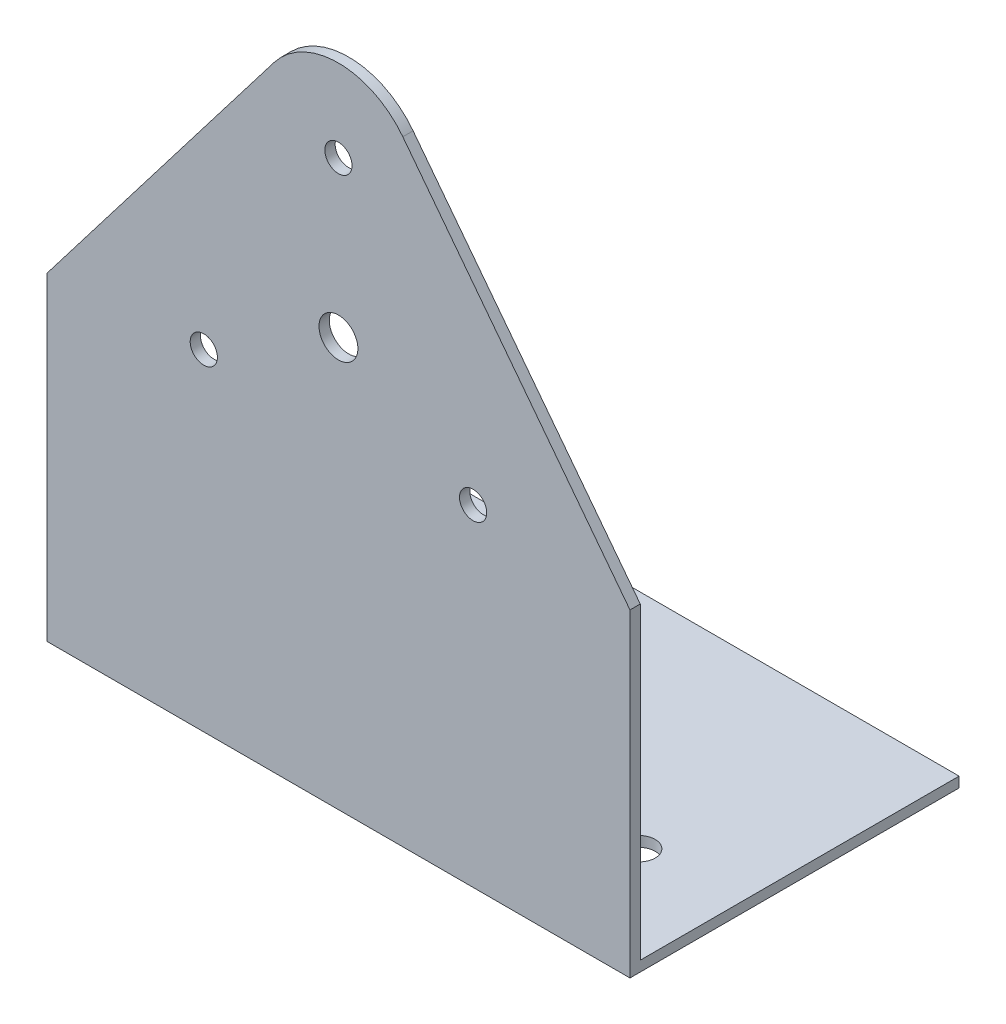
ISO-10303-21;
HEADER;
FILE_DESCRIPTION(('STEP AP214'),'2;1');
FILE_NAME('part.step','',(''),(''),'','','');
FILE_SCHEMA(('AUTOMOTIVE_DESIGN { 1 0 10303 214 1 1 1 1 }'));
ENDSEC;
DATA;
#1=APPLICATION_CONTEXT('core data for automotive mechanical design processes');
#2=APPLICATION_PROTOCOL_DEFINITION('international standard','automotive_design',2000,#1);
#3=PRODUCT_CONTEXT('',#1,'mechanical');
#4=PRODUCT('Part','Part','',(#3));
#5=PRODUCT_RELATED_PRODUCT_CATEGORY('part','',(#4));
#6=PRODUCT_DEFINITION_FORMATION('','',#4);
#7=PRODUCT_DEFINITION_CONTEXT('part definition',#1,'design');
#8=PRODUCT_DEFINITION('design','',#6,#7);
#9=PRODUCT_DEFINITION_SHAPE('','',#8);
#10=(LENGTH_UNIT() NAMED_UNIT(*) SI_UNIT(.MILLI.,.METRE.));
#11=(NAMED_UNIT(*) PLANE_ANGLE_UNIT() SI_UNIT($,.RADIAN.));
#12=(NAMED_UNIT(*) SI_UNIT($,.STERADIAN.) SOLID_ANGLE_UNIT());
#13=UNCERTAINTY_MEASURE_WITH_UNIT(LENGTH_MEASURE(1.E-05),#10,'distance_accuracy_value','');
#14=(GEOMETRIC_REPRESENTATION_CONTEXT(3) GLOBAL_UNCERTAINTY_ASSIGNED_CONTEXT((#13)) GLOBAL_UNIT_ASSIGNED_CONTEXT((#10,
#11,#12)) REPRESENTATION_CONTEXT('',''));
#15=CARTESIAN_POINT('',(0.,0.,0.));
#16=DIRECTION('',(0.,0.,1.));
#17=DIRECTION('',(1.,0.,0.));
#18=AXIS2_PLACEMENT_3D('',#15,#16,#17);
#19=CARTESIAN_POINT('',(90.,0.,0.));
#20=DIRECTION('',(0.,1.,0.));
#21=DIRECTION('',(0.,0.,1.));
#22=AXIS2_PLACEMENT_3D('',#19,#20,#21);
#23=PLANE('',#22);
#24=CARTESIAN_POINT('',(15.,0.,-16.3875));
#25=DIRECTION('',(0.,-1.,0.));
#26=DIRECTION('',(0.,0.,-1.));
#27=AXIS2_PLACEMENT_3D('',#24,#25,#26);
#28=CIRCLE('',#27,2.5);
#29=CARTESIAN_POINT('',(15.,0.,-18.8875));
#30=VERTEX_POINT('',#29);
#31=EDGE_CURVE('E160',#30,#30,#28,.T.);
#32=ORIENTED_EDGE('',*,*,#31,.F.);
#33=EDGE_LOOP('',(#32));
#34=FACE_BOUND('',#33,.T.);
#35=CARTESIAN_POINT('',(75.,0.,-16.3875));
#36=DIRECTION('',(0.,-1.,0.));
#37=DIRECTION('',(0.,0.,-1.));
#38=AXIS2_PLACEMENT_3D('',#35,#36,#37);
#39=CIRCLE('',#38,2.50000000000001);
#40=CARTESIAN_POINT('',(75.,0.,-18.8875));
#41=VERTEX_POINT('',#40);
#42=EDGE_CURVE('E168',#41,#41,#39,.T.);
#43=ORIENTED_EDGE('',*,*,#42,.F.);
#44=EDGE_LOOP('',(#43));
#45=FACE_BOUND('',#44,.T.);
#46=DIRECTION('',(0.,0.,-1.));
#47=VECTOR('',#46,1.);
#48=CARTESIAN_POINT('',(0.,0.,0.));
#49=LINE('',#48,#47);
#50=CARTESIAN_POINT('',(0.,0.,0.));
#51=VERTEX_POINT('',#50);
#52=CARTESIAN_POINT('',(0.,0.,-50.8));
#53=VERTEX_POINT('',#52);
#54=EDGE_CURVE('E133',#51,#53,#49,.T.);
#55=ORIENTED_EDGE('',*,*,#54,.T.);
#56=DIRECTION('',(-1.,0.,0.));
#57=VECTOR('',#56,1.);
#58=CARTESIAN_POINT('',(90.,0.,-50.8));
#59=LINE('',#58,#57);
#60=CARTESIAN_POINT('',(90.,0.,-50.8));
#61=VERTEX_POINT('',#60);
#62=EDGE_CURVE('E121',#61,#53,#59,.T.);
#63=ORIENTED_EDGE('',*,*,#62,.F.);
#64=DIRECTION('',(0.,0.,-1.));
#65=VECTOR('',#64,1.);
#66=CARTESIAN_POINT('',(90.,0.,0.));
#67=LINE('',#66,#65);
#68=CARTESIAN_POINT('',(90.,0.,0.));
#69=VERTEX_POINT('',#68);
#70=EDGE_CURVE('E135',#69,#61,#67,.T.);
#71=ORIENTED_EDGE('',*,*,#70,.F.);
#72=DIRECTION('',(-1.,0.,0.));
#73=VECTOR('',#72,1.);
#74=CARTESIAN_POINT('',(90.,0.,0.));
#75=LINE('',#74,#73);
#76=EDGE_CURVE('E145',#69,#51,#75,.T.);
#77=ORIENTED_EDGE('',*,*,#76,.T.);
#78=EDGE_LOOP('',(#55,#63,#71,#77));
#79=FACE_BOUND('',#78,.T.);
#80=ADVANCED_FACE('F38',(#34,#45,#79),#23,.F.);
#81=CARTESIAN_POINT('',(90.,0.,-50.8));
#82=DIRECTION('',(0.,0.,1.));
#83=DIRECTION('',(1.,0.,0.));
#84=AXIS2_PLACEMENT_3D('',#81,#82,#83);
#85=PLANE('',#84);
#86=DIRECTION('',(0.,1.,0.));
#87=VECTOR('',#86,1.);
#88=CARTESIAN_POINT('',(0.,0.,-50.8));
#89=LINE('',#88,#87);
#90=CARTESIAN_POINT('',(0.,1.5875,-50.8));
#91=VERTEX_POINT('',#90);
#92=EDGE_CURVE('E240',#53,#91,#89,.T.);
#93=ORIENTED_EDGE('',*,*,#92,.T.);
#94=DIRECTION('',(-1.,0.,0.));
#95=VECTOR('',#94,1.);
#96=CARTESIAN_POINT('',(90.,1.5875,-50.8));
#97=LINE('',#96,#95);
#98=CARTESIAN_POINT('',(90.,1.5875,-50.8));
#99=VERTEX_POINT('',#98);
#100=EDGE_CURVE('E152',#99,#91,#97,.T.);
#101=ORIENTED_EDGE('',*,*,#100,.F.);
#102=DIRECTION('',(0.,1.,0.));
#103=VECTOR('',#102,1.);
#104=CARTESIAN_POINT('',(90.,0.,-50.8));
#105=LINE('',#104,#103);
#106=EDGE_CURVE('E94',#61,#99,#105,.T.);
#107=ORIENTED_EDGE('',*,*,#106,.F.);
#108=ORIENTED_EDGE('',*,*,#62,.T.);
#109=EDGE_LOOP('',(#93,#101,#107,#108));
#110=FACE_BOUND('',#109,.T.);
#111=ADVANCED_FACE('F254',(#110),#85,.F.);
#112=CARTESIAN_POINT('',(90.,1.5875,-1.5875));
#113=DIRECTION('',(0.,-1.,0.));
#114=DIRECTION('',(0.,0.,-1.));
#115=AXIS2_PLACEMENT_3D('',#112,#113,#114);
#116=PLANE('',#115);
#117=CARTESIAN_POINT('',(15.,1.58750000000001,-16.3875));
#118=DIRECTION('',(0.,-1.,0.));
#119=DIRECTION('',(0.,0.,-1.));
#120=AXIS2_PLACEMENT_3D('',#117,#118,#119);
#121=CIRCLE('',#120,2.5);
#122=CARTESIAN_POINT('',(15.,1.58750000000001,-18.8875));
#123=VERTEX_POINT('',#122);
#124=EDGE_CURVE('E41',#123,#123,#121,.T.);
#125=ORIENTED_EDGE('',*,*,#124,.T.);
#126=EDGE_LOOP('',(#125));
#127=FACE_BOUND('',#126,.T.);
#128=CARTESIAN_POINT('',(75.,1.58750000000001,-16.3875));
#129=DIRECTION('',(0.,-1.,0.));
#130=DIRECTION('',(0.,0.,-1.));
#131=AXIS2_PLACEMENT_3D('',#128,#129,#130);
#132=CIRCLE('',#131,2.50000000000001);
#133=CARTESIAN_POINT('',(75.,1.58750000000001,-18.8875));
#134=VERTEX_POINT('',#133);
#135=EDGE_CURVE('E157',#134,#134,#132,.T.);
#136=ORIENTED_EDGE('',*,*,#135,.T.);
#137=EDGE_LOOP('',(#136));
#138=FACE_BOUND('',#137,.T.);
#139=DIRECTION('',(0.,0.,1.));
#140=VECTOR('',#139,1.);
#141=CARTESIAN_POINT('',(0.,1.5875,-1.5875));
#142=LINE('',#141,#140);
#143=CARTESIAN_POINT('',(0.,1.5875,-1.5875));
#144=VERTEX_POINT('',#143);
#145=EDGE_CURVE('E141',#91,#144,#142,.T.);
#146=ORIENTED_EDGE('',*,*,#145,.T.);
#147=DIRECTION('',(-1.,0.,0.));
#148=VECTOR('',#147,1.);
#149=CARTESIAN_POINT('',(90.,1.5875,-1.5875));
#150=LINE('',#149,#148);
#151=CARTESIAN_POINT('',(90.,1.5875,-1.5875));
#152=VERTEX_POINT('',#151);
#153=EDGE_CURVE('E148',#152,#144,#150,.T.);
#154=ORIENTED_EDGE('',*,*,#153,.F.);
#155=DIRECTION('',(0.,0.,1.));
#156=VECTOR('',#155,1.);
#157=CARTESIAN_POINT('',(90.,1.5875,-1.5875));
#158=LINE('',#157,#156);
#159=EDGE_CURVE('E229',#99,#152,#158,.T.);
#160=ORIENTED_EDGE('',*,*,#159,.F.);
#161=ORIENTED_EDGE('',*,*,#100,.T.);
#162=EDGE_LOOP('',(#146,#154,#160,#161));
#163=FACE_BOUND('',#162,.T.);
#164=ADVANCED_FACE('F246',(#127,#138,#163),#116,.F.);
#165=CARTESIAN_POINT('',(90.,1.5875,-1.5875));
#166=DIRECTION('',(0.,0.,1.));
#167=DIRECTION('',(0.,-1.,0.));
#168=AXIS2_PLACEMENT_3D('',#165,#166,#167);
#169=PLANE('',#168);
#170=CARTESIAN_POINT('',(45.,87.1212211943911,-1.5875));
#171=DIRECTION('',(0.,0.,1.));
#172=DIRECTION('',(0.,-1.,0.));
#173=AXIS2_PLACEMENT_3D('',#170,#171,#172);
#174=CIRCLE('',#173,2.1);
#175=CARTESIAN_POINT('',(45.,85.0212211943911,-1.5875));
#176=VERTEX_POINT('',#175);
#177=EDGE_CURVE('E128',#176,#176,#174,.T.);
#178=ORIENTED_EDGE('',*,*,#177,.T.);
#179=EDGE_LOOP('',(#178));
#180=FACE_BOUND('',#179,.T.);
#181=CARTESIAN_POINT('',(45.,63.1212211943911,-1.5875));
#182=DIRECTION('',(0.,0.,1.));
#183=DIRECTION('',(0.,-1.,0.));
#184=AXIS2_PLACEMENT_3D('',#181,#182,#183);
#185=CIRCLE('',#184,3.);
#186=CARTESIAN_POINT('',(45.,60.1212211943911,-1.5875));
#187=VERTEX_POINT('',#186);
#188=EDGE_CURVE('E199',#187,#187,#185,.T.);
#189=ORIENTED_EDGE('',*,*,#188,.T.);
#190=EDGE_LOOP('',(#189));
#191=FACE_BOUND('',#190,.T.);
#192=CARTESIAN_POINT('',(65.7846096908275,51.1212211943916,-1.5875));
#193=DIRECTION('',(0.,0.,1.));
#194=DIRECTION('',(0.,-1.,0.));
#195=AXIS2_PLACEMENT_3D('',#192,#193,#194);
#196=CIRCLE('',#195,2.1);
#197=CARTESIAN_POINT('',(65.7846096908275,49.0212211943916,-1.5875));
#198=VERTEX_POINT('',#197);
#199=EDGE_CURVE('E195',#198,#198,#196,.T.);
#200=ORIENTED_EDGE('',*,*,#199,.T.);
#201=EDGE_LOOP('',(#200));
#202=FACE_BOUND('',#201,.T.);
#203=CARTESIAN_POINT('',(24.2153903091735,51.1212211943911,-1.5875));
#204=DIRECTION('',(0.,0.,1.));
#205=DIRECTION('',(0.,-1.,0.));
#206=AXIS2_PLACEMENT_3D('',#203,#204,#205);
#207=CIRCLE('',#206,2.09999999999909);
#208=CARTESIAN_POINT('',(24.2153903091735,49.021221194392,-1.5875));
#209=VERTEX_POINT('',#208);
#210=EDGE_CURVE('E180',#209,#209,#207,.T.);
#211=ORIENTED_EDGE('',*,*,#210,.T.);
#212=EDGE_LOOP('',(#211));
#213=FACE_BOUND('',#212,.T.);
#214=CARTESIAN_POINT('',(45.,87.3,-1.5875));
#215=DIRECTION('',(0.,0.,1.));
#216=DIRECTION('',(0.,-1.,0.));
#217=AXIS2_PLACEMENT_3D('',#214,#215,#216);
#218=CIRCLE('',#217,12.5212211943911);
#219=CARTESIAN_POINT('',(35.0643782178029,94.92,-1.5875));
#220=VERTEX_POINT('',#219);
#221=CARTESIAN_POINT('',(54.9356217821971,94.92,-1.5875));
#222=VERTEX_POINT('',#221);
#223=EDGE_CURVE('E223',#220,#222,#218,.F.);
#224=ORIENTED_EDGE('',*,*,#223,.T.);
#225=DIRECTION('',(0.608566838785132,-0.793502616713437,0.));
#226=VECTOR('',#225,1.);
#227=CARTESIAN_POINT('',(112.992046683639,19.2209606499669,-1.5875));
#228=LINE('',#227,#226);
#229=CARTESIAN_POINT('',(90.,49.2,-1.5875));
#230=VERTEX_POINT('',#229);
#231=EDGE_CURVE('E219',#222,#230,#228,.T.);
#232=ORIENTED_EDGE('',*,*,#231,.T.);
#233=DIRECTION('',(0.,1.,0.));
#234=VECTOR('',#233,1.);
#235=CARTESIAN_POINT('',(90.,1.5875,-1.5875));
#236=LINE('',#235,#234);
#237=EDGE_CURVE('E232',#152,#230,#236,.T.);
#238=ORIENTED_EDGE('',*,*,#237,.F.);
#239=ORIENTED_EDGE('',*,*,#153,.T.);
#240=DIRECTION('',(0.,1.,0.));
#241=VECTOR('',#240,1.);
#242=CARTESIAN_POINT('',(0.,1.5875,-1.5875));
#243=LINE('',#242,#241);
#244=CARTESIAN_POINT('',(0.,49.2,-1.5875));
#245=VERTEX_POINT('',#244);
#246=EDGE_CURVE('E136',#144,#245,#243,.T.);
#247=ORIENTED_EDGE('',*,*,#246,.T.);
#248=DIRECTION('',(0.608566838785132,0.793502616713437,0.));
#249=VECTOR('',#248,1.);
#250=CARTESIAN_POINT('',(10.339777070565,62.6819047618592,-1.5875));
#251=LINE('',#250,#249);
#252=EDGE_CURVE('E55',#245,#220,#251,.T.);
#253=ORIENTED_EDGE('',*,*,#252,.T.);
#254=EDGE_LOOP('',(#224,#232,#238,#239,#247,#253));
#255=FACE_BOUND('',#254,.T.);
#256=ADVANCED_FACE('F250',(#180,#191,#202,#213,#255),#169,.F.);
#257=CARTESIAN_POINT('',(90.,0.,0.));
#258=DIRECTION('',(0.,0.,-1.));
#259=DIRECTION('',(-1.,0.,0.));
#260=AXIS2_PLACEMENT_3D('',#257,#258,#259);
#261=PLANE('',#260);
#262=CARTESIAN_POINT('',(45.,87.1212211943911,0.));
#263=DIRECTION('',(0.,0.,1.));
#264=DIRECTION('',(1.,0.,0.));
#265=AXIS2_PLACEMENT_3D('',#262,#263,#264);
#266=CIRCLE('',#265,2.1);
#267=CARTESIAN_POINT('',(47.1,87.1212211943911,0.));
#268=VERTEX_POINT('',#267);
#269=EDGE_CURVE('E176',#268,#268,#266,.T.);
#270=ORIENTED_EDGE('',*,*,#269,.F.);
#271=EDGE_LOOP('',(#270));
#272=FACE_BOUND('',#271,.T.);
#273=CARTESIAN_POINT('',(45.,63.1212211943911,0.));
#274=DIRECTION('',(0.,0.,1.));
#275=DIRECTION('',(1.,0.,0.));
#276=AXIS2_PLACEMENT_3D('',#273,#274,#275);
#277=CIRCLE('',#276,3.);
#278=CARTESIAN_POINT('',(48.,63.1212211943911,0.));
#279=VERTEX_POINT('',#278);
#280=EDGE_CURVE('E181',#279,#279,#277,.T.);
#281=ORIENTED_EDGE('',*,*,#280,.F.);
#282=EDGE_LOOP('',(#281));
#283=FACE_BOUND('',#282,.T.);
#284=CARTESIAN_POINT('',(65.7846096908275,51.1212211943916,0.));
#285=DIRECTION('',(0.,0.,1.));
#286=DIRECTION('',(1.,0.,0.));
#287=AXIS2_PLACEMENT_3D('',#284,#285,#286);
#288=CIRCLE('',#287,2.1);
#289=CARTESIAN_POINT('',(67.8846096908275,51.1212211943916,0.));
#290=VERTEX_POINT('',#289);
#291=EDGE_CURVE('E185',#290,#290,#288,.T.);
#292=ORIENTED_EDGE('',*,*,#291,.F.);
#293=EDGE_LOOP('',(#292));
#294=FACE_BOUND('',#293,.T.);
#295=CARTESIAN_POINT('',(24.2153903091735,51.1212211943911,0.));
#296=DIRECTION('',(0.,0.,1.));
#297=DIRECTION('',(1.,0.,0.));
#298=AXIS2_PLACEMENT_3D('',#295,#296,#297);
#299=CIRCLE('',#298,2.09999999999909);
#300=CARTESIAN_POINT('',(26.3153903091726,51.1212211943911,0.));
#301=VERTEX_POINT('',#300);
#302=EDGE_CURVE('E166',#301,#301,#299,.T.);
#303=ORIENTED_EDGE('',*,*,#302,.F.);
#304=EDGE_LOOP('',(#303));
#305=FACE_BOUND('',#304,.T.);
#306=DIRECTION('',(0.,-1.,0.));
#307=VECTOR('',#306,1.);
#308=CARTESIAN_POINT('',(90.,0.,0.));
#309=LINE('',#308,#307);
#310=CARTESIAN_POINT('',(90.,49.2,0.));
#311=VERTEX_POINT('',#310);
#312=EDGE_CURVE('E64',#311,#69,#309,.T.);
#313=ORIENTED_EDGE('',*,*,#312,.F.);
#314=DIRECTION('',(0.608566838785132,-0.793502616713437,0.));
#315=VECTOR('',#314,1.);
#316=CARTESIAN_POINT('',(54.9356217821971,94.92,0.));
#317=LINE('',#316,#315);
#318=CARTESIAN_POINT('',(54.9356217821971,94.92,0.));
#319=VERTEX_POINT('',#318);
#320=EDGE_CURVE('E208',#319,#311,#317,.T.);
#321=ORIENTED_EDGE('',*,*,#320,.F.);
#322=CARTESIAN_POINT('',(45.,87.3,0.));
#323=DIRECTION('',(0.,0.,-1.));
#324=DIRECTION('',(1.,0.,0.));
#325=AXIS2_PLACEMENT_3D('',#322,#323,#324);
#326=CIRCLE('',#325,12.5212211943911);
#327=CARTESIAN_POINT('',(35.0643782178029,94.92,0.));
#328=VERTEX_POINT('',#327);
#329=EDGE_CURVE('E126',#328,#319,#326,.T.);
#330=ORIENTED_EDGE('',*,*,#329,.F.);
#331=DIRECTION('',(0.608566838785132,0.793502616713437,0.));
#332=VECTOR('',#331,1.);
#333=CARTESIAN_POINT('',(35.0643782178029,94.92,0.));
#334=LINE('',#333,#332);
#335=CARTESIAN_POINT('',(0.,49.2,0.));
#336=VERTEX_POINT('',#335);
#337=EDGE_CURVE('E115',#336,#328,#334,.T.);
#338=ORIENTED_EDGE('',*,*,#337,.F.);
#339=DIRECTION('',(0.,-1.,0.));
#340=VECTOR('',#339,1.);
#341=CARTESIAN_POINT('',(0.,0.,0.));
#342=LINE('',#341,#340);
#343=EDGE_CURVE('E86',#336,#51,#342,.T.);
#344=ORIENTED_EDGE('',*,*,#343,.T.);
#345=ORIENTED_EDGE('',*,*,#76,.F.);
#346=EDGE_LOOP('',(#313,#321,#330,#338,#344,#345));
#347=FACE_BOUND('',#346,.T.);
#348=ADVANCED_FACE('F123',(#272,#283,#294,#305,#347),#261,.F.);
#349=CARTESIAN_POINT('',(90.,0.,0.));
#350=DIRECTION('',(1.,0.,0.));
#351=DIRECTION('',(0.,0.,-1.));
#352=AXIS2_PLACEMENT_3D('',#349,#350,#351);
#353=PLANE('',#352);
#354=DIRECTION('',(0.,0.,-1.));
#355=VECTOR('',#354,1.);
#356=CARTESIAN_POINT('',(90.,49.2,0.));
#357=LINE('',#356,#355);
#358=EDGE_CURVE('E11',#311,#230,#357,.T.);
#359=ORIENTED_EDGE('',*,*,#358,.F.);
#360=ORIENTED_EDGE('',*,*,#312,.T.);
#361=ORIENTED_EDGE('',*,*,#70,.T.);
#362=ORIENTED_EDGE('',*,*,#106,.T.);
#363=ORIENTED_EDGE('',*,*,#159,.T.);
#364=ORIENTED_EDGE('',*,*,#237,.T.);
#365=EDGE_LOOP('',(#359,#360,#361,#362,#363,#364));
#366=FACE_BOUND('',#365,.T.);
#367=ADVANCED_FACE('F251',(#366),#353,.T.);
#368=CARTESIAN_POINT('',(0.,0.,0.));
#369=DIRECTION('',(1.,0.,0.));
#370=DIRECTION('',(0.,0.,-1.));
#371=AXIS2_PLACEMENT_3D('',#368,#369,#370);
#372=PLANE('',#371);
#373=ORIENTED_EDGE('',*,*,#343,.F.);
#374=DIRECTION('',(0.,0.,-1.));
#375=VECTOR('',#374,1.);
#376=CARTESIAN_POINT('',(0.,49.2,0.));
#377=LINE('',#376,#375);
#378=EDGE_CURVE('E47',#336,#245,#377,.T.);
#379=ORIENTED_EDGE('',*,*,#378,.T.);
#380=ORIENTED_EDGE('',*,*,#246,.F.);
#381=ORIENTED_EDGE('',*,*,#145,.F.);
#382=ORIENTED_EDGE('',*,*,#92,.F.);
#383=ORIENTED_EDGE('',*,*,#54,.F.);
#384=EDGE_LOOP('',(#373,#379,#380,#381,#382,#383));
#385=FACE_BOUND('',#384,.T.);
#386=ADVANCED_FACE('F131',(#385),#372,.F.);
#387=CARTESIAN_POINT('',(45.,87.3,-50.8));
#388=DIRECTION('',(0.,0.,1.));
#389=DIRECTION('',(1.,0.,0.));
#390=AXIS2_PLACEMENT_3D('',#387,#388,#389);
#391=CYLINDRICAL_SURFACE('',#390,12.5212211943911);
#392=DIRECTION('',(0.,0.,1.));
#393=VECTOR('',#392,1.);
#394=CARTESIAN_POINT('',(35.0643782178029,94.92,-50.8));
#395=LINE('',#394,#393);
#396=EDGE_CURVE('E211',#220,#328,#395,.T.);
#397=ORIENTED_EDGE('',*,*,#396,.T.);
#398=ORIENTED_EDGE('',*,*,#329,.T.);
#399=DIRECTION('',(0.,0.,1.));
#400=VECTOR('',#399,1.);
#401=CARTESIAN_POINT('',(54.9356217821971,94.92,-50.8));
#402=LINE('',#401,#400);
#403=EDGE_CURVE('E212',#222,#319,#402,.T.);
#404=ORIENTED_EDGE('',*,*,#403,.F.);
#405=ORIENTED_EDGE('',*,*,#223,.F.);
#406=EDGE_LOOP('',(#397,#398,#404,#405));
#407=FACE_BOUND('',#406,.T.);
#408=ADVANCED_FACE('F260',(#407),#391,.T.);
#409=CARTESIAN_POINT('',(54.9356217821971,94.92,-50.8));
#410=DIRECTION('',(-0.793502616713437,-0.608566838785132,0.));
#411=DIRECTION('',(0.608566838785132,-0.793502616713437,0.));
#412=AXIS2_PLACEMENT_3D('',#409,#410,#411);
#413=PLANE('',#412);
#414=ORIENTED_EDGE('',*,*,#403,.T.);
#415=ORIENTED_EDGE('',*,*,#320,.T.);
#416=ORIENTED_EDGE('',*,*,#358,.T.);
#417=ORIENTED_EDGE('',*,*,#231,.F.);
#418=EDGE_LOOP('',(#414,#415,#416,#417));
#419=FACE_BOUND('',#418,.T.);
#420=ADVANCED_FACE('F257',(#419),#413,.F.);
#421=CARTESIAN_POINT('',(35.0643782178029,94.92,-50.8));
#422=DIRECTION('',(0.793502616713437,-0.608566838785132,0.));
#423=DIRECTION('',(0.608566838785132,0.793502616713437,0.));
#424=AXIS2_PLACEMENT_3D('',#421,#422,#423);
#425=PLANE('',#424);
#426=ORIENTED_EDGE('',*,*,#378,.F.);
#427=ORIENTED_EDGE('',*,*,#337,.T.);
#428=ORIENTED_EDGE('',*,*,#396,.F.);
#429=ORIENTED_EDGE('',*,*,#252,.F.);
#430=EDGE_LOOP('',(#426,#427,#428,#429));
#431=FACE_BOUND('',#430,.T.);
#432=ADVANCED_FACE('F114',(#431),#425,.F.);
#433=CARTESIAN_POINT('',(24.2153903091735,51.1212211943911,-50.8));
#434=DIRECTION('',(0.,0.,1.));
#435=DIRECTION('',(1.,0.,0.));
#436=AXIS2_PLACEMENT_3D('',#433,#434,#435);
#437=CYLINDRICAL_SURFACE('',#436,2.09999999999909);
#438=ORIENTED_EDGE('',*,*,#302,.T.);
#439=EDGE_LOOP('',(#438));
#440=FACE_BOUND('',#439,.T.);
#441=ORIENTED_EDGE('',*,*,#210,.F.);
#442=EDGE_LOOP('',(#441));
#443=FACE_BOUND('',#442,.T.);
#444=ADVANCED_FACE('F301',(#440,#443),#437,.F.);
#445=CARTESIAN_POINT('',(65.7846096908275,51.1212211943916,-50.8));
#446=DIRECTION('',(0.,0.,1.));
#447=DIRECTION('',(1.,0.,0.));
#448=AXIS2_PLACEMENT_3D('',#445,#446,#447);
#449=CYLINDRICAL_SURFACE('',#448,2.1);
#450=ORIENTED_EDGE('',*,*,#291,.T.);
#451=EDGE_LOOP('',(#450));
#452=FACE_BOUND('',#451,.T.);
#453=ORIENTED_EDGE('',*,*,#199,.F.);
#454=EDGE_LOOP('',(#453));
#455=FACE_BOUND('',#454,.T.);
#456=ADVANCED_FACE('F297',(#452,#455),#449,.F.);
#457=CARTESIAN_POINT('',(45.,63.1212211943911,-50.8));
#458=DIRECTION('',(0.,0.,1.));
#459=DIRECTION('',(1.,0.,0.));
#460=AXIS2_PLACEMENT_3D('',#457,#458,#459);
#461=CYLINDRICAL_SURFACE('',#460,3.);
#462=ORIENTED_EDGE('',*,*,#280,.T.);
#463=EDGE_LOOP('',(#462));
#464=FACE_BOUND('',#463,.T.);
#465=ORIENTED_EDGE('',*,*,#188,.F.);
#466=EDGE_LOOP('',(#465));
#467=FACE_BOUND('',#466,.T.);
#468=ADVANCED_FACE('F291',(#464,#467),#461,.F.);
#469=CARTESIAN_POINT('',(45.,87.1212211943911,-50.8));
#470=DIRECTION('',(0.,0.,1.));
#471=DIRECTION('',(1.,0.,0.));
#472=AXIS2_PLACEMENT_3D('',#469,#470,#471);
#473=CYLINDRICAL_SURFACE('',#472,2.1);
#474=ORIENTED_EDGE('',*,*,#269,.T.);
#475=EDGE_LOOP('',(#474));
#476=FACE_BOUND('',#475,.T.);
#477=ORIENTED_EDGE('',*,*,#177,.F.);
#478=EDGE_LOOP('',(#477));
#479=FACE_BOUND('',#478,.T.);
#480=ADVANCED_FACE('F284',(#476,#479),#473,.F.);
#481=CARTESIAN_POINT('',(75.,99.8212211943911,-16.3875));
#482=DIRECTION('',(0.,-1.,0.));
#483=DIRECTION('',(0.,0.,-1.));
#484=AXIS2_PLACEMENT_3D('',#481,#482,#483);
#485=CYLINDRICAL_SURFACE('',#484,2.50000000000001);
#486=ORIENTED_EDGE('',*,*,#42,.T.);
#487=EDGE_LOOP('',(#486));
#488=FACE_BOUND('',#487,.T.);
#489=ORIENTED_EDGE('',*,*,#135,.F.);
#490=EDGE_LOOP('',(#489));
#491=FACE_BOUND('',#490,.T.);
#492=ADVANCED_FACE('F280',(#488,#491),#485,.F.);
#493=CARTESIAN_POINT('',(15.,99.8212211943911,-16.3875));
#494=DIRECTION('',(0.,-1.,0.));
#495=DIRECTION('',(0.,0.,-1.));
#496=AXIS2_PLACEMENT_3D('',#493,#494,#495);
#497=CYLINDRICAL_SURFACE('',#496,2.5);
#498=ORIENTED_EDGE('',*,*,#31,.T.);
#499=EDGE_LOOP('',(#498));
#500=FACE_BOUND('',#499,.T.);
#501=ORIENTED_EDGE('',*,*,#124,.F.);
#502=EDGE_LOOP('',(#501));
#503=FACE_BOUND('',#502,.T.);
#504=ADVANCED_FACE('F283',(#500,#503),#497,.F.);
#505=CLOSED_SHELL('',(#80,#111,#164,#256,#348,#367,#386,#408,#420,#432,#444,#456,#468,#480,#492,#504));
#506=MANIFOLD_SOLID_BREP('B2',#505);
#507=ADVANCED_BREP_SHAPE_REPRESENTATION('',(#18,#506),#14);
#508=SHAPE_DEFINITION_REPRESENTATION(#9,#507);
ENDSEC;
END-ISO-10303-21;
